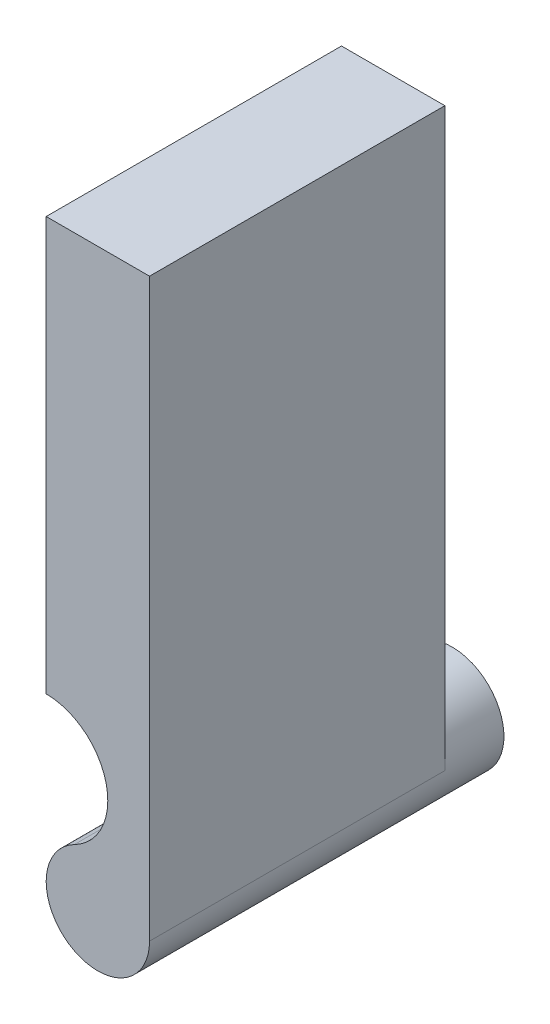
ISO-10303-21;
HEADER;
FILE_DESCRIPTION(('STEP AP214'),'2;1');
FILE_NAME('part.step','',(''),(''),'','','');
FILE_SCHEMA(('AUTOMOTIVE_DESIGN { 1 0 10303 214 1 1 1 1 }'));
ENDSEC;
DATA;
#1=APPLICATION_CONTEXT('core data for automotive mechanical design processes');
#2=APPLICATION_PROTOCOL_DEFINITION('international standard','automotive_design',2000,#1);
#3=PRODUCT_CONTEXT('',#1,'mechanical');
#4=PRODUCT('Part','Part','',(#3));
#5=PRODUCT_RELATED_PRODUCT_CATEGORY('part','',(#4));
#6=PRODUCT_DEFINITION_FORMATION('','',#4);
#7=PRODUCT_DEFINITION_CONTEXT('part definition',#1,'design');
#8=PRODUCT_DEFINITION('design','',#6,#7);
#9=PRODUCT_DEFINITION_SHAPE('','',#8);
#10=(LENGTH_UNIT() NAMED_UNIT(*) SI_UNIT(.MILLI.,.METRE.));
#11=(NAMED_UNIT(*) PLANE_ANGLE_UNIT() SI_UNIT($,.RADIAN.));
#12=(NAMED_UNIT(*) SI_UNIT($,.STERADIAN.) SOLID_ANGLE_UNIT());
#13=UNCERTAINTY_MEASURE_WITH_UNIT(LENGTH_MEASURE(1.E-05),#10,'distance_accuracy_value','');
#14=(GEOMETRIC_REPRESENTATION_CONTEXT(3) GLOBAL_UNCERTAINTY_ASSIGNED_CONTEXT((#13)) GLOBAL_UNIT_ASSIGNED_CONTEXT((#10,
#11,#12)) REPRESENTATION_CONTEXT('',''));
#15=CARTESIAN_POINT('',(0.,0.,0.));
#16=DIRECTION('',(0.,0.,1.));
#17=DIRECTION('',(1.,0.,0.));
#18=AXIS2_PLACEMENT_3D('',#15,#16,#17);
#19=CARTESIAN_POINT('',(0.,0.,0.));
#20=DIRECTION('',(0.,0.,1.));
#21=DIRECTION('',(1.,0.,0.));
#22=AXIS2_PLACEMENT_3D('',#19,#20,#21);
#23=PLANE('',#22);
#24=CARTESIAN_POINT('',(0.,0.,0.));
#25=DIRECTION('',(0.,0.,-1.));
#26=DIRECTION('',(-1.,0.,0.));
#27=AXIS2_PLACEMENT_3D('',#24,#25,#26);
#28=CIRCLE('',#27,1.75);
#29=CARTESIAN_POINT('',(-0.798314606741573,1.55730337078652,0.));
#30=VERTEX_POINT('',#29);
#31=CARTESIAN_POINT('',(1.75,0.,0.));
#32=VERTEX_POINT('',#31);
#33=EDGE_CURVE('E131',#30,#32,#28,.T.);
#34=ORIENTED_EDGE('',*,*,#33,.F.);
#35=CARTESIAN_POINT('',(-1.75,3.41379310344828,0.));
#36=DIRECTION('',(0.,0.,-1.));
#37=DIRECTION('',(-1.,0.,0.));
#38=AXIS2_PLACEMENT_3D('',#35,#36,#37);
#39=CIRCLE('',#38,2.08620689655172);
#40=CARTESIAN_POINT('',(-1.75,5.5,0.));
#41=VERTEX_POINT('',#40);
#42=EDGE_CURVE('E121',#41,#30,#39,.T.);
#43=ORIENTED_EDGE('',*,*,#42,.F.);
#44=DIRECTION('',(0.,-1.,0.));
#45=VECTOR('',#44,1.);
#46=CARTESIAN_POINT('',(-1.75,19.5,0.));
#47=LINE('',#46,#45);
#48=CARTESIAN_POINT('',(-1.75,19.5,0.));
#49=VERTEX_POINT('',#48);
#50=EDGE_CURVE('E88',#49,#41,#47,.T.);
#51=ORIENTED_EDGE('',*,*,#50,.F.);
#52=DIRECTION('',(-1.,0.,0.));
#53=VECTOR('',#52,1.);
#54=CARTESIAN_POINT('',(-1.75,19.5,0.));
#55=LINE('',#54,#53);
#56=CARTESIAN_POINT('',(1.75,19.5,0.));
#57=VERTEX_POINT('',#56);
#58=EDGE_CURVE('E81',#57,#49,#55,.T.);
#59=ORIENTED_EDGE('',*,*,#58,.F.);
#60=DIRECTION('',(0.,1.,0.));
#61=VECTOR('',#60,1.);
#62=CARTESIAN_POINT('',(1.75,0.,0.));
#63=LINE('',#62,#61);
#64=EDGE_CURVE('E116',#32,#57,#63,.T.);
#65=ORIENTED_EDGE('',*,*,#64,.F.);
#66=EDGE_LOOP('',(#34,#43,#51,#59,#65));
#67=FACE_BOUND('',#66,.T.);
#68=ADVANCED_FACE('F46',(#67),#23,.F.);
#69=CARTESIAN_POINT('',(0.,0.,10.));
#70=DIRECTION('',(0.,0.,-1.));
#71=DIRECTION('',(-1.,0.,0.));
#72=AXIS2_PLACEMENT_3D('',#69,#70,#71);
#73=CYLINDRICAL_SURFACE('',#72,1.75);
#74=DIRECTION('',(0.,0.,-1.));
#75=VECTOR('',#74,1.);
#76=CARTESIAN_POINT('',(-0.798314606741572,1.55730337078652,10.));
#77=LINE('',#76,#75);
#78=CARTESIAN_POINT('',(-0.798314606741572,1.55730337078652,10.));
#79=VERTEX_POINT('',#78);
#80=EDGE_CURVE('E112',#79,#30,#77,.T.);
#81=ORIENTED_EDGE('',*,*,#80,.T.);
#82=ORIENTED_EDGE('',*,*,#33,.T.);
#83=DIRECTION('',(0.,0.,-1.));
#84=VECTOR('',#83,1.);
#85=CARTESIAN_POINT('',(1.75,0.,10.));
#86=LINE('',#85,#84);
#87=CARTESIAN_POINT('',(1.75,0.,10.));
#88=VERTEX_POINT('',#87);
#89=EDGE_CURVE('E13',#88,#32,#86,.T.);
#90=ORIENTED_EDGE('',*,*,#89,.F.);
#91=CARTESIAN_POINT('',(0.,0.,10.));
#92=DIRECTION('',(0.,0.,1.));
#93=DIRECTION('',(1.,0.,0.));
#94=AXIS2_PLACEMENT_3D('',#91,#92,#93);
#95=CIRCLE('',#94,1.75);
#96=EDGE_CURVE('E124',#79,#88,#95,.T.);
#97=ORIENTED_EDGE('',*,*,#96,.F.);
#98=EDGE_LOOP('',(#81,#82,#90,#97));
#99=FACE_BOUND('',#98,.T.);
#100=CARTESIAN_POINT('',(0.,0.,-2.));
#101=DIRECTION('',(0.,0.,-1.));
#102=DIRECTION('',(-1.,0.,0.));
#103=AXIS2_PLACEMENT_3D('',#100,#101,#102);
#104=CIRCLE('',#103,1.75);
#105=CARTESIAN_POINT('',(-1.75,0.,-2.));
#106=VERTEX_POINT('',#105);
#107=EDGE_CURVE('E118',#106,#106,#104,.T.);
#108=ORIENTED_EDGE('',*,*,#107,.F.);
#109=EDGE_LOOP('',(#108));
#110=FACE_BOUND('',#109,.T.);
#111=ADVANCED_FACE('F48',(#99,#110),#73,.T.);
#112=CARTESIAN_POINT('',(1.75,0.,10.));
#113=DIRECTION('',(-1.,0.,0.));
#114=DIRECTION('',(0.,-1.,0.));
#115=AXIS2_PLACEMENT_3D('',#112,#113,#114);
#116=PLANE('',#115);
#117=ORIENTED_EDGE('',*,*,#64,.T.);
#118=DIRECTION('',(0.,0.,-1.));
#119=VECTOR('',#118,1.);
#120=CARTESIAN_POINT('',(1.75,19.5,10.));
#121=LINE('',#120,#119);
#122=CARTESIAN_POINT('',(1.75,19.5,10.));
#123=VERTEX_POINT('',#122);
#124=EDGE_CURVE('E55',#123,#57,#121,.T.);
#125=ORIENTED_EDGE('',*,*,#124,.F.);
#126=DIRECTION('',(0.,1.,0.));
#127=VECTOR('',#126,1.);
#128=CARTESIAN_POINT('',(1.75,0.,10.));
#129=LINE('',#128,#127);
#130=EDGE_CURVE('E96',#88,#123,#129,.T.);
#131=ORIENTED_EDGE('',*,*,#130,.F.);
#132=ORIENTED_EDGE('',*,*,#89,.T.);
#133=EDGE_LOOP('',(#117,#125,#131,#132));
#134=FACE_BOUND('',#133,.T.);
#135=ADVANCED_FACE('F146',(#134),#116,.F.);
#136=CARTESIAN_POINT('',(-1.75,19.5,10.));
#137=DIRECTION('',(0.,-1.,0.));
#138=DIRECTION('',(0.,0.,-1.));
#139=AXIS2_PLACEMENT_3D('',#136,#137,#138);
#140=PLANE('',#139);
#141=ORIENTED_EDGE('',*,*,#58,.T.);
#142=DIRECTION('',(0.,0.,-1.));
#143=VECTOR('',#142,1.);
#144=CARTESIAN_POINT('',(-1.75,19.5,10.));
#145=LINE('',#144,#143);
#146=CARTESIAN_POINT('',(-1.75,19.5,10.));
#147=VERTEX_POINT('',#146);
#148=EDGE_CURVE('E106',#147,#49,#145,.T.);
#149=ORIENTED_EDGE('',*,*,#148,.F.);
#150=DIRECTION('',(-1.,0.,0.));
#151=VECTOR('',#150,1.);
#152=CARTESIAN_POINT('',(-1.75,19.5,10.));
#153=LINE('',#152,#151);
#154=EDGE_CURVE('E101',#123,#147,#153,.T.);
#155=ORIENTED_EDGE('',*,*,#154,.F.);
#156=ORIENTED_EDGE('',*,*,#124,.T.);
#157=EDGE_LOOP('',(#141,#149,#155,#156));
#158=FACE_BOUND('',#157,.T.);
#159=ADVANCED_FACE('F107',(#158),#140,.F.);
#160=CARTESIAN_POINT('',(-1.75,19.5,10.));
#161=DIRECTION('',(1.,0.,0.));
#162=DIRECTION('',(0.,1.,0.));
#163=AXIS2_PLACEMENT_3D('',#160,#161,#162);
#164=PLANE('',#163);
#165=ORIENTED_EDGE('',*,*,#50,.T.);
#166=DIRECTION('',(0.,0.,-1.));
#167=VECTOR('',#166,1.);
#168=CARTESIAN_POINT('',(-1.75,5.5,10.));
#169=LINE('',#168,#167);
#170=CARTESIAN_POINT('',(-1.75,5.5,10.));
#171=VERTEX_POINT('',#170);
#172=EDGE_CURVE('E108',#171,#41,#169,.T.);
#173=ORIENTED_EDGE('',*,*,#172,.F.);
#174=DIRECTION('',(0.,-1.,0.));
#175=VECTOR('',#174,1.);
#176=CARTESIAN_POINT('',(-1.75,19.5,10.));
#177=LINE('',#176,#175);
#178=EDGE_CURVE('E104',#147,#171,#177,.T.);
#179=ORIENTED_EDGE('',*,*,#178,.F.);
#180=ORIENTED_EDGE('',*,*,#148,.T.);
#181=EDGE_LOOP('',(#165,#173,#179,#180));
#182=FACE_BOUND('',#181,.T.);
#183=ADVANCED_FACE('F110',(#182),#164,.F.);
#184=CARTESIAN_POINT('',(-1.75,3.41379310344828,10.));
#185=DIRECTION('',(0.,0.,-1.));
#186=DIRECTION('',(-1.,0.,0.));
#187=AXIS2_PLACEMENT_3D('',#184,#185,#186);
#188=CYLINDRICAL_SURFACE('',#187,2.08620689655172);
#189=ORIENTED_EDGE('',*,*,#42,.T.);
#190=ORIENTED_EDGE('',*,*,#80,.F.);
#191=CARTESIAN_POINT('',(-1.75,3.41379310344828,10.));
#192=DIRECTION('',(0.,0.,-1.));
#193=DIRECTION('',(-1.,0.,0.));
#194=AXIS2_PLACEMENT_3D('',#191,#192,#193);
#195=CIRCLE('',#194,2.08620689655172);
#196=EDGE_CURVE('E63',#171,#79,#195,.T.);
#197=ORIENTED_EDGE('',*,*,#196,.F.);
#198=ORIENTED_EDGE('',*,*,#172,.T.);
#199=EDGE_LOOP('',(#189,#190,#197,#198));
#200=FACE_BOUND('',#199,.T.);
#201=ADVANCED_FACE('F133',(#200),#188,.F.);
#202=CARTESIAN_POINT('',(0.,0.,10.));
#203=DIRECTION('',(0.,0.,1.));
#204=DIRECTION('',(1.,0.,0.));
#205=AXIS2_PLACEMENT_3D('',#202,#203,#204);
#206=PLANE('',#205);
#207=ORIENTED_EDGE('',*,*,#96,.T.);
#208=ORIENTED_EDGE('',*,*,#130,.T.);
#209=ORIENTED_EDGE('',*,*,#154,.T.);
#210=ORIENTED_EDGE('',*,*,#178,.T.);
#211=ORIENTED_EDGE('',*,*,#196,.T.);
#212=EDGE_LOOP('',(#207,#208,#209,#210,#211));
#213=FACE_BOUND('',#212,.T.);
#214=ADVANCED_FACE('F102',(#213),#206,.T.);
#215=CARTESIAN_POINT('',(0.,0.,-2.));
#216=DIRECTION('',(0.,0.,-1.));
#217=DIRECTION('',(-1.,0.,0.));
#218=AXIS2_PLACEMENT_3D('',#215,#216,#217);
#219=PLANE('',#218);
#220=ORIENTED_EDGE('',*,*,#107,.T.);
#221=EDGE_LOOP('',(#220));
#222=FACE_BOUND('',#221,.T.);
#223=ADVANCED_FACE('F144',(#222),#219,.T.);
#224=CLOSED_SHELL('',(#68,#111,#135,#159,#183,#201,#214,#223));
#225=MANIFOLD_SOLID_BREP('B2',#224);
#226=ADVANCED_BREP_SHAPE_REPRESENTATION('',(#18,#225),#14);
#227=SHAPE_DEFINITION_REPRESENTATION(#9,#226);
ENDSEC;
END-ISO-10303-21;
